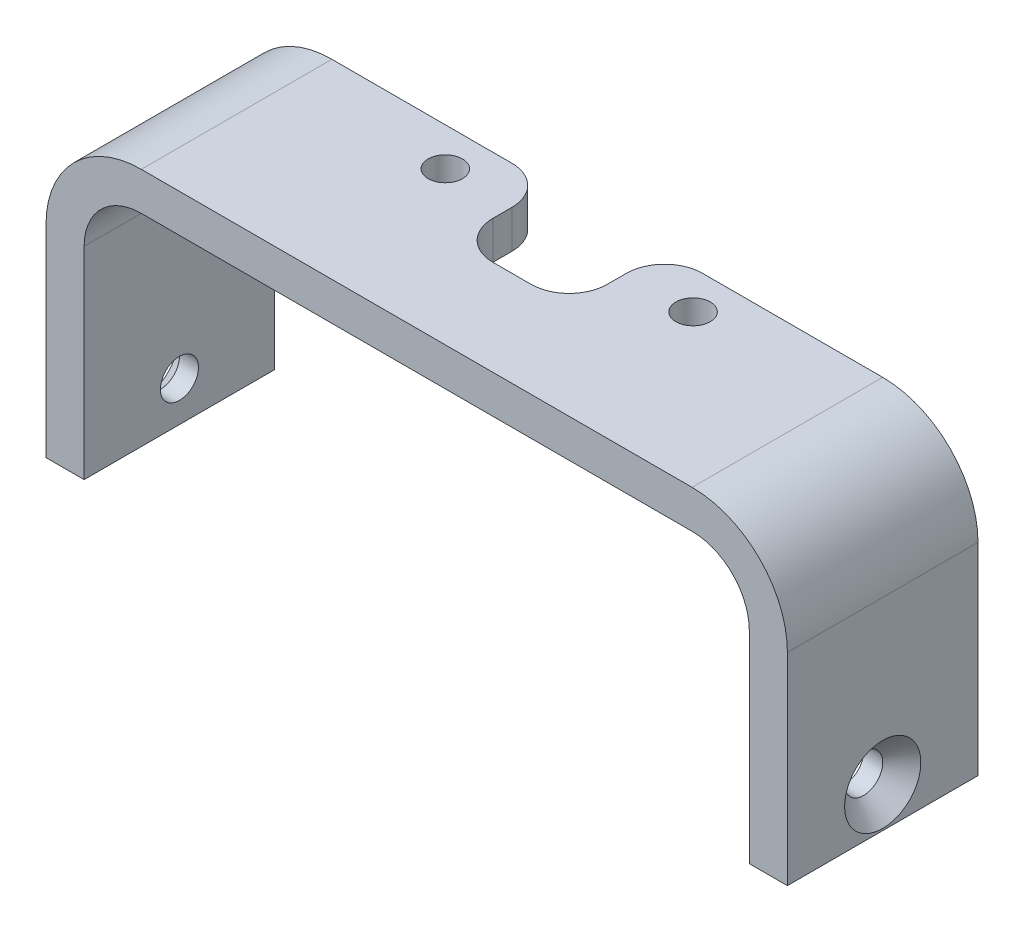
ISO-10303-21;
HEADER;
FILE_DESCRIPTION(('STEP AP214'),'2;1');
FILE_NAME('part.step','',(''),(''),'','','');
FILE_SCHEMA(('AUTOMOTIVE_DESIGN { 1 0 10303 214 1 1 1 1 }'));
ENDSEC;
DATA;
#1=APPLICATION_CONTEXT('core data for automotive mechanical design processes');
#2=APPLICATION_PROTOCOL_DEFINITION('international standard','automotive_design',2000,#1);
#3=PRODUCT_CONTEXT('',#1,'mechanical');
#4=PRODUCT('Part','Part','',(#3));
#5=PRODUCT_RELATED_PRODUCT_CATEGORY('part','',(#4));
#6=PRODUCT_DEFINITION_FORMATION('','',#4);
#7=PRODUCT_DEFINITION_CONTEXT('part definition',#1,'design');
#8=PRODUCT_DEFINITION('design','',#6,#7);
#9=PRODUCT_DEFINITION_SHAPE('','',#8);
#10=(LENGTH_UNIT() NAMED_UNIT(*) SI_UNIT(.MILLI.,.METRE.));
#11=(NAMED_UNIT(*) PLANE_ANGLE_UNIT() SI_UNIT($,.RADIAN.));
#12=(NAMED_UNIT(*) SI_UNIT($,.STERADIAN.) SOLID_ANGLE_UNIT());
#13=UNCERTAINTY_MEASURE_WITH_UNIT(LENGTH_MEASURE(1.E-05),#10,'distance_accuracy_value','');
#14=(GEOMETRIC_REPRESENTATION_CONTEXT(3) GLOBAL_UNCERTAINTY_ASSIGNED_CONTEXT((#13)) GLOBAL_UNIT_ASSIGNED_CONTEXT((#10,
#11,#12)) REPRESENTATION_CONTEXT('',''));
#15=CARTESIAN_POINT('',(0.,0.,0.));
#16=DIRECTION('',(0.,0.,1.));
#17=DIRECTION('',(1.,0.,0.));
#18=AXIS2_PLACEMENT_3D('',#15,#16,#17);
#19=CARTESIAN_POINT('',(-14.45,10.6,0.));
#20=DIRECTION('',(0.,0.,1.));
#21=DIRECTION('',(1.,0.,0.));
#22=AXIS2_PLACEMENT_3D('',#19,#20,#21);
#23=PLANE('',#22);
#24=DIRECTION('',(1.,0.,0.));
#25=VECTOR('',#24,1.);
#26=CARTESIAN_POINT('',(-14.45,13.6,0.));
#27=LINE('',#26,#25);
#28=CARTESIAN_POINT('',(4.99999999999999,13.6,0.));
#29=VERTEX_POINT('',#28);
#30=CARTESIAN_POINT('',(14.45,13.6,0.));
#31=VERTEX_POINT('',#30);
#32=EDGE_CURVE('E360',#29,#31,#27,.T.);
#33=ORIENTED_EDGE('',*,*,#32,.F.);
#34=DIRECTION('',(0.,1.,0.));
#35=VECTOR('',#34,1.);
#36=CARTESIAN_POINT('',(4.99999999999999,10.6,0.));
#37=LINE('',#36,#35);
#38=CARTESIAN_POINT('',(4.99999999999999,15.6,0.));
#39=VERTEX_POINT('',#38);
#40=EDGE_CURVE('E228',#29,#39,#37,.T.);
#41=ORIENTED_EDGE('',*,*,#40,.T.);
#42=DIRECTION('',(-1.,0.,0.));
#43=VECTOR('',#42,1.);
#44=CARTESIAN_POINT('',(-14.45,15.6,0.));
#45=LINE('',#44,#43);
#46=CARTESIAN_POINT('',(14.45,15.6,0.));
#47=VERTEX_POINT('',#46);
#48=EDGE_CURVE('E380',#47,#39,#45,.T.);
#49=ORIENTED_EDGE('',*,*,#48,.F.);
#50=CARTESIAN_POINT('',(14.45,10.6,0.));
#51=DIRECTION('',(0.,0.,1.));
#52=DIRECTION('',(1.,0.,0.));
#53=AXIS2_PLACEMENT_3D('',#50,#51,#52);
#54=CIRCLE('',#53,5.);
#55=CARTESIAN_POINT('',(19.45,10.6,0.));
#56=VERTEX_POINT('',#55);
#57=EDGE_CURVE('E376',#56,#47,#54,.T.);
#58=ORIENTED_EDGE('',*,*,#57,.F.);
#59=DIRECTION('',(0.,1.,0.));
#60=VECTOR('',#59,1.);
#61=CARTESIAN_POINT('',(19.45,0.,0.));
#62=LINE('',#61,#60);
#63=CARTESIAN_POINT('',(19.45,0.,0.));
#64=VERTEX_POINT('',#63);
#65=EDGE_CURVE('E373',#64,#56,#62,.T.);
#66=ORIENTED_EDGE('',*,*,#65,.F.);
#67=DIRECTION('',(1.,0.,0.));
#68=VECTOR('',#67,1.);
#69=CARTESIAN_POINT('',(17.45,0.,0.));
#70=LINE('',#69,#68);
#71=CARTESIAN_POINT('',(17.45,0.,0.));
#72=VERTEX_POINT('',#71);
#73=EDGE_CURVE('E370',#72,#64,#70,.T.);
#74=ORIENTED_EDGE('',*,*,#73,.F.);
#75=DIRECTION('',(0.,-1.,0.));
#76=VECTOR('',#75,1.);
#77=CARTESIAN_POINT('',(17.45,0.,0.));
#78=LINE('',#77,#76);
#79=CARTESIAN_POINT('',(17.45,10.6,0.));
#80=VERTEX_POINT('',#79);
#81=EDGE_CURVE('E367',#80,#72,#78,.T.);
#82=ORIENTED_EDGE('',*,*,#81,.F.);
#83=CARTESIAN_POINT('',(14.45,10.6,0.));
#84=DIRECTION('',(0.,0.,-1.));
#85=DIRECTION('',(1.,0.,0.));
#86=AXIS2_PLACEMENT_3D('',#83,#84,#85);
#87=CIRCLE('',#86,3.);
#88=EDGE_CURVE('E364',#31,#80,#87,.T.);
#89=ORIENTED_EDGE('',*,*,#88,.F.);
#90=EDGE_LOOP('',(#33,#41,#49,#58,#66,#74,#82,#89));
#91=FACE_BOUND('',#90,.T.);
#92=ADVANCED_FACE('F40',(#91),#23,.F.);
#93=CARTESIAN_POINT('',(-19.45,0.,10.));
#94=DIRECTION('',(0.,1.,0.));
#95=DIRECTION('',(0.,0.,1.));
#96=AXIS2_PLACEMENT_3D('',#93,#94,#95);
#97=PLANE('',#96);
#98=DIRECTION('',(1.,0.,0.));
#99=VECTOR('',#98,1.);
#100=CARTESIAN_POINT('',(-19.45,0.,0.));
#101=LINE('',#100,#99);
#102=CARTESIAN_POINT('',(-19.45,0.,0.));
#103=VERTEX_POINT('',#102);
#104=CARTESIAN_POINT('',(-17.45,0.,0.));
#105=VERTEX_POINT('',#104);
#106=EDGE_CURVE('E204',#103,#105,#101,.T.);
#107=ORIENTED_EDGE('',*,*,#106,.T.);
#108=DIRECTION('',(0.,0.,-1.));
#109=VECTOR('',#108,1.);
#110=CARTESIAN_POINT('',(-17.45,0.,10.));
#111=LINE('',#110,#109);
#112=CARTESIAN_POINT('',(-17.45,0.,10.));
#113=VERTEX_POINT('',#112);
#114=EDGE_CURVE('E182',#113,#105,#111,.T.);
#115=ORIENTED_EDGE('',*,*,#114,.F.);
#116=DIRECTION('',(1.,0.,0.));
#117=VECTOR('',#116,1.);
#118=CARTESIAN_POINT('',(-19.45,0.,10.));
#119=LINE('',#118,#117);
#120=CARTESIAN_POINT('',(-19.45,0.,10.));
#121=VERTEX_POINT('',#120);
#122=EDGE_CURVE('E190',#121,#113,#119,.T.);
#123=ORIENTED_EDGE('',*,*,#122,.F.);
#124=DIRECTION('',(0.,0.,-1.));
#125=VECTOR('',#124,1.);
#126=CARTESIAN_POINT('',(-19.45,0.,10.));
#127=LINE('',#126,#125);
#128=EDGE_CURVE('E351',#121,#103,#127,.T.);
#129=ORIENTED_EDGE('',*,*,#128,.T.);
#130=EDGE_LOOP('',(#107,#115,#123,#129));
#131=FACE_BOUND('',#130,.T.);
#132=ADVANCED_FACE('F202',(#131),#97,.F.);
#133=CARTESIAN_POINT('',(-17.45,0.,10.));
#134=DIRECTION('',(-1.,0.,0.));
#135=DIRECTION('',(0.,-1.,0.));
#136=AXIS2_PLACEMENT_3D('',#133,#134,#135);
#137=PLANE('',#136);
#138=CARTESIAN_POINT('',(-17.45,2.1,5.));
#139=DIRECTION('',(-1.,0.,0.));
#140=DIRECTION('',(0.,-1.,0.));
#141=AXIS2_PLACEMENT_3D('',#138,#139,#140);
#142=CIRCLE('',#141,1.);
#143=CARTESIAN_POINT('',(-17.45,1.1,5.));
#144=VERTEX_POINT('',#143);
#145=EDGE_CURVE('E319',#144,#144,#142,.T.);
#146=ORIENTED_EDGE('',*,*,#145,.T.);
#147=EDGE_LOOP('',(#146));
#148=FACE_BOUND('',#147,.T.);
#149=DIRECTION('',(0.,1.,0.));
#150=VECTOR('',#149,1.);
#151=CARTESIAN_POINT('',(-17.45,0.,0.));
#152=LINE('',#151,#150);
#153=CARTESIAN_POINT('',(-17.45,10.6,0.));
#154=VERTEX_POINT('',#153);
#155=EDGE_CURVE('E354',#105,#154,#152,.T.);
#156=ORIENTED_EDGE('',*,*,#155,.T.);
#157=DIRECTION('',(0.,0.,-1.));
#158=VECTOR('',#157,1.);
#159=CARTESIAN_POINT('',(-17.45,10.6,10.));
#160=LINE('',#159,#158);
#161=CARTESIAN_POINT('',(-17.45,10.6,10.));
#162=VERTEX_POINT('',#161);
#163=EDGE_CURVE('E185',#162,#154,#160,.T.);
#164=ORIENTED_EDGE('',*,*,#163,.F.);
#165=DIRECTION('',(0.,1.,0.));
#166=VECTOR('',#165,1.);
#167=CARTESIAN_POINT('',(-17.45,0.,10.));
#168=LINE('',#167,#166);
#169=EDGE_CURVE('E178',#113,#162,#168,.T.);
#170=ORIENTED_EDGE('',*,*,#169,.F.);
#171=ORIENTED_EDGE('',*,*,#114,.T.);
#172=EDGE_LOOP('',(#156,#164,#170,#171));
#173=FACE_BOUND('',#172,.T.);
#174=ADVANCED_FACE('F180',(#148,#173),#137,.F.);
#175=CARTESIAN_POINT('',(-14.45,10.6,10.));
#176=DIRECTION('',(0.,0.,-1.));
#177=DIRECTION('',(-1.,0.,0.));
#178=AXIS2_PLACEMENT_3D('',#175,#176,#177);
#179=CYLINDRICAL_SURFACE('',#178,3.);
#180=CARTESIAN_POINT('',(-14.45,10.6,0.));
#181=DIRECTION('',(0.,0.,-1.));
#182=DIRECTION('',(1.,0.,0.));
#183=AXIS2_PLACEMENT_3D('',#180,#181,#182);
#184=CIRCLE('',#183,3.);
#185=CARTESIAN_POINT('',(-14.45,13.6,0.));
#186=VERTEX_POINT('',#185);
#187=EDGE_CURVE('E357',#154,#186,#184,.T.);
#188=ORIENTED_EDGE('',*,*,#187,.T.);
#189=DIRECTION('',(0.,0.,-1.));
#190=VECTOR('',#189,1.);
#191=CARTESIAN_POINT('',(-14.45,13.6,10.));
#192=LINE('',#191,#190);
#193=CARTESIAN_POINT('',(-14.45,13.6,10.));
#194=VERTEX_POINT('',#193);
#195=EDGE_CURVE('E213',#194,#186,#192,.T.);
#196=ORIENTED_EDGE('',*,*,#195,.F.);
#197=CARTESIAN_POINT('',(-14.45,10.6,10.));
#198=DIRECTION('',(0.,0.,-1.));
#199=DIRECTION('',(1.,0.,0.));
#200=AXIS2_PLACEMENT_3D('',#197,#198,#199);
#201=CIRCLE('',#200,3.);
#202=EDGE_CURVE('E189',#162,#194,#201,.T.);
#203=ORIENTED_EDGE('',*,*,#202,.F.);
#204=ORIENTED_EDGE('',*,*,#163,.T.);
#205=EDGE_LOOP('',(#188,#196,#203,#204));
#206=FACE_BOUND('',#205,.T.);
#207=ADVANCED_FACE('F511',(#206),#179,.F.);
#208=CARTESIAN_POINT('',(-14.45,13.6,10.));
#209=DIRECTION('',(0.,1.,0.));
#210=DIRECTION('',(-1.,0.,0.));
#211=AXIS2_PLACEMENT_3D('',#208,#209,#210);
#212=PLANE('',#211);
#213=CARTESIAN_POINT('',(-6.5,13.6,2.));
#214=DIRECTION('',(0.,1.,0.));
#215=DIRECTION('',(-1.,0.,0.));
#216=AXIS2_PLACEMENT_3D('',#213,#214,#215);
#217=CIRCLE('',#216,0.899999999999999);
#218=CARTESIAN_POINT('',(-7.4,13.6,2.));
#219=VERTEX_POINT('',#218);
#220=EDGE_CURVE('E307',#219,#219,#217,.T.);
#221=ORIENTED_EDGE('',*,*,#220,.T.);
#222=EDGE_LOOP('',(#221));
#223=FACE_BOUND('',#222,.T.);
#224=CARTESIAN_POINT('',(6.5,13.6,2.));
#225=DIRECTION('',(0.,1.,0.));
#226=DIRECTION('',(-1.,0.,0.));
#227=AXIS2_PLACEMENT_3D('',#224,#225,#226);
#228=CIRCLE('',#227,0.9);
#229=CARTESIAN_POINT('',(5.6,13.6,2.));
#230=VERTEX_POINT('',#229);
#231=EDGE_CURVE('E301',#230,#230,#228,.T.);
#232=ORIENTED_EDGE('',*,*,#231,.T.);
#233=EDGE_LOOP('',(#232));
#234=FACE_BOUND('',#233,.T.);
#235=DIRECTION('',(0.,0.,-1.));
#236=VECTOR('',#235,1.);
#237=CARTESIAN_POINT('',(3.,13.6,10.));
#238=LINE('',#237,#236);
#239=CARTESIAN_POINT('',(2.99999999999999,13.6,3.));
#240=VERTEX_POINT('',#239);
#241=CARTESIAN_POINT('',(2.99999999999999,13.6,2.));
#242=VERTEX_POINT('',#241);
#243=EDGE_CURVE('E302',#240,#242,#238,.T.);
#244=ORIENTED_EDGE('',*,*,#243,.T.);
#245=CARTESIAN_POINT('',(4.99999999999999,13.6,2.));
#246=DIRECTION('',(0.,1.,0.));
#247=DIRECTION('',(-1.,0.,0.));
#248=AXIS2_PLACEMENT_3D('',#245,#246,#247);
#249=CIRCLE('',#248,2.);
#250=EDGE_CURVE('E247',#242,#29,#249,.F.);
#251=ORIENTED_EDGE('',*,*,#250,.T.);
#252=ORIENTED_EDGE('',*,*,#32,.T.);
#253=DIRECTION('',(0.,0.,-1.));
#254=VECTOR('',#253,1.);
#255=CARTESIAN_POINT('',(14.45,13.6,10.));
#256=LINE('',#255,#254);
#257=CARTESIAN_POINT('',(14.45,13.6,10.));
#258=VERTEX_POINT('',#257);
#259=EDGE_CURVE('E418',#258,#31,#256,.T.);
#260=ORIENTED_EDGE('',*,*,#259,.F.);
#261=DIRECTION('',(1.,0.,0.));
#262=VECTOR('',#261,1.);
#263=CARTESIAN_POINT('',(-14.45,13.6,10.));
#264=LINE('',#263,#262);
#265=EDGE_CURVE('E325',#194,#258,#264,.T.);
#266=ORIENTED_EDGE('',*,*,#265,.F.);
#267=ORIENTED_EDGE('',*,*,#195,.T.);
#268=CARTESIAN_POINT('',(-5.,13.6,0.));
#269=VERTEX_POINT('',#268);
#270=EDGE_CURVE('E361',#186,#269,#27,.T.);
#271=ORIENTED_EDGE('',*,*,#270,.T.);
#272=CARTESIAN_POINT('',(-5.,13.6,2.));
#273=DIRECTION('',(0.,1.,0.));
#274=DIRECTION('',(-1.,0.,0.));
#275=AXIS2_PLACEMENT_3D('',#272,#273,#274);
#276=CIRCLE('',#275,2.);
#277=CARTESIAN_POINT('',(-3.,13.6,2.));
#278=VERTEX_POINT('',#277);
#279=EDGE_CURVE('E63',#269,#278,#276,.F.);
#280=ORIENTED_EDGE('',*,*,#279,.T.);
#281=DIRECTION('',(0.,0.,1.));
#282=VECTOR('',#281,1.);
#283=CARTESIAN_POINT('',(-3.,13.6,10.));
#284=LINE('',#283,#282);
#285=CARTESIAN_POINT('',(-3.,13.6,3.));
#286=VERTEX_POINT('',#285);
#287=EDGE_CURVE('E296',#278,#286,#284,.T.);
#288=ORIENTED_EDGE('',*,*,#287,.T.);
#289=CARTESIAN_POINT('',(-1.,13.6,3.));
#290=DIRECTION('',(0.,1.,0.));
#291=DIRECTION('',(-1.,0.,0.));
#292=AXIS2_PLACEMENT_3D('',#289,#290,#291);
#293=CIRCLE('',#292,2.);
#294=CARTESIAN_POINT('',(-1.,13.6,5.));
#295=VERTEX_POINT('',#294);
#296=EDGE_CURVE('E11',#286,#295,#293,.T.);
#297=ORIENTED_EDGE('',*,*,#296,.T.);
#298=DIRECTION('',(1.,0.,0.));
#299=VECTOR('',#298,1.);
#300=CARTESIAN_POINT('',(-14.45,13.6,5.));
#301=LINE('',#300,#299);
#302=CARTESIAN_POINT('',(0.999999999999997,13.6,5.00000000000001));
#303=VERTEX_POINT('',#302);
#304=EDGE_CURVE('E294',#295,#303,#301,.T.);
#305=ORIENTED_EDGE('',*,*,#304,.T.);
#306=CARTESIAN_POINT('',(0.999999999999997,13.6,3.));
#307=DIRECTION('',(0.,1.,0.));
#308=DIRECTION('',(-1.,0.,0.));
#309=AXIS2_PLACEMENT_3D('',#306,#307,#308);
#310=CIRCLE('',#309,2.);
#311=EDGE_CURVE('E269',#303,#240,#310,.T.);
#312=ORIENTED_EDGE('',*,*,#311,.T.);
#313=EDGE_LOOP('',(#244,#251,#252,#260,#266,#267,#271,#280,#288,#297,#305,#312));
#314=FACE_BOUND('',#313,.T.);
#315=ADVANCED_FACE('F293',(#223,#234,#314),#212,.F.);
#316=CARTESIAN_POINT('',(14.45,10.6,10.));
#317=DIRECTION('',(0.,0.,-1.));
#318=DIRECTION('',(-1.,0.,0.));
#319=AXIS2_PLACEMENT_3D('',#316,#317,#318);
#320=CYLINDRICAL_SURFACE('',#319,3.);
#321=ORIENTED_EDGE('',*,*,#88,.T.);
#322=DIRECTION('',(0.,0.,-1.));
#323=VECTOR('',#322,1.);
#324=CARTESIAN_POINT('',(17.45,10.6,10.));
#325=LINE('',#324,#323);
#326=CARTESIAN_POINT('',(17.45,10.6,10.));
#327=VERTEX_POINT('',#326);
#328=EDGE_CURVE('E414',#327,#80,#325,.T.);
#329=ORIENTED_EDGE('',*,*,#328,.F.);
#330=CARTESIAN_POINT('',(14.45,10.6,10.));
#331=DIRECTION('',(0.,0.,-1.));
#332=DIRECTION('',(1.,0.,0.));
#333=AXIS2_PLACEMENT_3D('',#330,#331,#332);
#334=CIRCLE('',#333,3.);
#335=EDGE_CURVE('E328',#258,#327,#334,.T.);
#336=ORIENTED_EDGE('',*,*,#335,.F.);
#337=ORIENTED_EDGE('',*,*,#259,.T.);
#338=EDGE_LOOP('',(#321,#329,#336,#337));
#339=FACE_BOUND('',#338,.T.);
#340=ADVANCED_FACE('F510',(#339),#320,.F.);
#341=CARTESIAN_POINT('',(17.45,0.,10.));
#342=DIRECTION('',(1.,0.,0.));
#343=DIRECTION('',(0.,1.,0.));
#344=AXIS2_PLACEMENT_3D('',#341,#342,#343);
#345=PLANE('',#344);
#346=CARTESIAN_POINT('',(17.45,2.1,5.));
#347=DIRECTION('',(1.,0.,0.));
#348=DIRECTION('',(0.,1.,0.));
#349=AXIS2_PLACEMENT_3D('',#346,#347,#348);
#350=CIRCLE('',#349,1.);
#351=CARTESIAN_POINT('',(17.45,3.1,5.));
#352=VERTEX_POINT('',#351);
#353=EDGE_CURVE('E315',#352,#352,#350,.T.);
#354=ORIENTED_EDGE('',*,*,#353,.T.);
#355=EDGE_LOOP('',(#354));
#356=FACE_BOUND('',#355,.T.);
#357=ORIENTED_EDGE('',*,*,#81,.T.);
#358=DIRECTION('',(0.,0.,-1.));
#359=VECTOR('',#358,1.);
#360=CARTESIAN_POINT('',(17.45,0.,10.));
#361=LINE('',#360,#359);
#362=CARTESIAN_POINT('',(17.45,0.,10.));
#363=VERTEX_POINT('',#362);
#364=EDGE_CURVE('E410',#363,#72,#361,.T.);
#365=ORIENTED_EDGE('',*,*,#364,.F.);
#366=DIRECTION('',(0.,-1.,0.));
#367=VECTOR('',#366,1.);
#368=CARTESIAN_POINT('',(17.45,0.,10.));
#369=LINE('',#368,#367);
#370=EDGE_CURVE('E331',#327,#363,#369,.T.);
#371=ORIENTED_EDGE('',*,*,#370,.F.);
#372=ORIENTED_EDGE('',*,*,#328,.T.);
#373=EDGE_LOOP('',(#357,#365,#371,#372));
#374=FACE_BOUND('',#373,.T.);
#375=ADVANCED_FACE('F518',(#356,#374),#345,.F.);
#376=CARTESIAN_POINT('',(17.45,0.,10.));
#377=DIRECTION('',(0.,1.,0.));
#378=DIRECTION('',(-1.,0.,0.));
#379=AXIS2_PLACEMENT_3D('',#376,#377,#378);
#380=PLANE('',#379);
#381=ORIENTED_EDGE('',*,*,#73,.T.);
#382=DIRECTION('',(0.,0.,-1.));
#383=VECTOR('',#382,1.);
#384=CARTESIAN_POINT('',(19.45,0.,10.));
#385=LINE('',#384,#383);
#386=CARTESIAN_POINT('',(19.45,0.,10.));
#387=VERTEX_POINT('',#386);
#388=EDGE_CURVE('E406',#387,#64,#385,.T.);
#389=ORIENTED_EDGE('',*,*,#388,.F.);
#390=DIRECTION('',(1.,0.,0.));
#391=VECTOR('',#390,1.);
#392=CARTESIAN_POINT('',(17.45,0.,10.));
#393=LINE('',#392,#391);
#394=EDGE_CURVE('E334',#363,#387,#393,.T.);
#395=ORIENTED_EDGE('',*,*,#394,.F.);
#396=ORIENTED_EDGE('',*,*,#364,.T.);
#397=EDGE_LOOP('',(#381,#389,#395,#396));
#398=FACE_BOUND('',#397,.T.);
#399=ADVANCED_FACE('F624',(#398),#380,.F.);
#400=CARTESIAN_POINT('',(19.45,0.,10.));
#401=DIRECTION('',(-1.,0.,0.));
#402=DIRECTION('',(0.,0.,1.));
#403=AXIS2_PLACEMENT_3D('',#400,#401,#402);
#404=PLANE('',#403);
#405=CARTESIAN_POINT('',(19.45,2.1,5.));
#406=DIRECTION('',(-1.,0.,0.));
#407=DIRECTION('',(0.,0.,1.));
#408=AXIS2_PLACEMENT_3D('',#405,#406,#407);
#409=CIRCLE('',#408,2.);
#410=CARTESIAN_POINT('',(19.45,2.1,7.));
#411=VERTEX_POINT('',#410);
#412=EDGE_CURVE('E220',#411,#411,#409,.T.);
#413=ORIENTED_EDGE('',*,*,#412,.T.);
#414=EDGE_LOOP('',(#413));
#415=FACE_BOUND('',#414,.T.);
#416=ORIENTED_EDGE('',*,*,#65,.T.);
#417=DIRECTION('',(0.,0.,-1.));
#418=VECTOR('',#417,1.);
#419=CARTESIAN_POINT('',(19.45,10.6,10.));
#420=LINE('',#419,#418);
#421=CARTESIAN_POINT('',(19.45,10.6,10.));
#422=VERTEX_POINT('',#421);
#423=EDGE_CURVE('E402',#422,#56,#420,.T.);
#424=ORIENTED_EDGE('',*,*,#423,.F.);
#425=DIRECTION('',(0.,1.,0.));
#426=VECTOR('',#425,1.);
#427=CARTESIAN_POINT('',(19.45,0.,10.));
#428=LINE('',#427,#426);
#429=EDGE_CURVE('E337',#387,#422,#428,.T.);
#430=ORIENTED_EDGE('',*,*,#429,.F.);
#431=ORIENTED_EDGE('',*,*,#388,.T.);
#432=EDGE_LOOP('',(#416,#424,#430,#431));
#433=FACE_BOUND('',#432,.T.);
#434=ADVANCED_FACE('F618',(#415,#433),#404,.F.);
#435=CARTESIAN_POINT('',(14.45,10.6,10.));
#436=DIRECTION('',(0.,0.,-1.));
#437=DIRECTION('',(-1.,0.,0.));
#438=AXIS2_PLACEMENT_3D('',#435,#436,#437);
#439=CYLINDRICAL_SURFACE('',#438,5.);
#440=ORIENTED_EDGE('',*,*,#57,.T.);
#441=DIRECTION('',(0.,0.,-1.));
#442=VECTOR('',#441,1.);
#443=CARTESIAN_POINT('',(14.45,15.6,10.));
#444=LINE('',#443,#442);
#445=CARTESIAN_POINT('',(14.45,15.6,10.));
#446=VERTEX_POINT('',#445);
#447=EDGE_CURVE('E398',#446,#47,#444,.T.);
#448=ORIENTED_EDGE('',*,*,#447,.F.);
#449=CARTESIAN_POINT('',(14.45,10.6,10.));
#450=DIRECTION('',(0.,0.,1.));
#451=DIRECTION('',(1.,0.,0.));
#452=AXIS2_PLACEMENT_3D('',#449,#450,#451);
#453=CIRCLE('',#452,5.);
#454=EDGE_CURVE('E340',#422,#446,#453,.T.);
#455=ORIENTED_EDGE('',*,*,#454,.F.);
#456=ORIENTED_EDGE('',*,*,#423,.T.);
#457=EDGE_LOOP('',(#440,#448,#455,#456));
#458=FACE_BOUND('',#457,.T.);
#459=ADVANCED_FACE('F623',(#458),#439,.T.);
#460=CARTESIAN_POINT('',(-14.45,15.6,10.));
#461=DIRECTION('',(0.,-1.,0.));
#462=DIRECTION('',(1.,0.,0.));
#463=AXIS2_PLACEMENT_3D('',#460,#461,#462);
#464=PLANE('',#463);
#465=CARTESIAN_POINT('',(-6.5,15.6,2.));
#466=DIRECTION('',(0.,1.,0.));
#467=DIRECTION('',(-1.,0.,0.));
#468=AXIS2_PLACEMENT_3D('',#465,#466,#467);
#469=CIRCLE('',#468,0.899999999999999);
#470=CARTESIAN_POINT('',(-7.4,15.6,2.));
#471=VERTEX_POINT('',#470);
#472=EDGE_CURVE('E506',#471,#471,#469,.T.);
#473=ORIENTED_EDGE('',*,*,#472,.F.);
#474=EDGE_LOOP('',(#473));
#475=FACE_BOUND('',#474,.T.);
#476=CARTESIAN_POINT('',(6.5,15.6,2.));
#477=DIRECTION('',(0.,1.,0.));
#478=DIRECTION('',(-1.,0.,0.));
#479=AXIS2_PLACEMENT_3D('',#476,#477,#478);
#480=CIRCLE('',#479,0.9);
#481=CARTESIAN_POINT('',(5.6,15.6,2.));
#482=VERTEX_POINT('',#481);
#483=EDGE_CURVE('E701',#482,#482,#480,.T.);
#484=ORIENTED_EDGE('',*,*,#483,.F.);
#485=EDGE_LOOP('',(#484));
#486=FACE_BOUND('',#485,.T.);
#487=ORIENTED_EDGE('',*,*,#48,.T.);
#488=CARTESIAN_POINT('',(4.99999999999999,15.6,2.));
#489=DIRECTION('',(0.,-1.,0.));
#490=DIRECTION('',(1.,0.,0.));
#491=AXIS2_PLACEMENT_3D('',#488,#489,#490);
#492=CIRCLE('',#491,2.);
#493=CARTESIAN_POINT('',(3.,15.6,2.));
#494=VERTEX_POINT('',#493);
#495=EDGE_CURVE('E235',#39,#494,#492,.F.);
#496=ORIENTED_EDGE('',*,*,#495,.T.);
#497=DIRECTION('',(0.,0.,-1.));
#498=VECTOR('',#497,1.);
#499=CARTESIAN_POINT('',(3.,15.6,0.));
#500=LINE('',#499,#498);
#501=CARTESIAN_POINT('',(3.,15.6,3.));
#502=VERTEX_POINT('',#501);
#503=EDGE_CURVE('E286',#502,#494,#500,.T.);
#504=ORIENTED_EDGE('',*,*,#503,.F.);
#505=CARTESIAN_POINT('',(0.999999999999997,15.6,3.));
#506=DIRECTION('',(0.,-1.,0.));
#507=DIRECTION('',(1.,0.,0.));
#508=AXIS2_PLACEMENT_3D('',#505,#506,#507);
#509=CIRCLE('',#508,2.);
#510=CARTESIAN_POINT('',(0.999999999999997,15.6,5.00000000000001));
#511=VERTEX_POINT('',#510);
#512=EDGE_CURVE('E266',#502,#511,#509,.T.);
#513=ORIENTED_EDGE('',*,*,#512,.T.);
#514=DIRECTION('',(1.,0.,0.));
#515=VECTOR('',#514,1.);
#516=CARTESIAN_POINT('',(3.,15.6,5.00000000000001));
#517=LINE('',#516,#515);
#518=CARTESIAN_POINT('',(-1.,15.6,5.));
#519=VERTEX_POINT('',#518);
#520=EDGE_CURVE('E280',#519,#511,#517,.T.);
#521=ORIENTED_EDGE('',*,*,#520,.F.);
#522=CARTESIAN_POINT('',(-1.,15.6,3.));
#523=DIRECTION('',(0.,-1.,0.));
#524=DIRECTION('',(1.,0.,0.));
#525=AXIS2_PLACEMENT_3D('',#522,#523,#524);
#526=CIRCLE('',#525,2.);
#527=CARTESIAN_POINT('',(-3.,15.6,3.));
#528=VERTEX_POINT('',#527);
#529=EDGE_CURVE('E49',#519,#528,#526,.T.);
#530=ORIENTED_EDGE('',*,*,#529,.T.);
#531=DIRECTION('',(0.,0.,1.));
#532=VECTOR('',#531,1.);
#533=CARTESIAN_POINT('',(-3.,15.6,0.));
#534=LINE('',#533,#532);
#535=CARTESIAN_POINT('',(-3.,15.6,2.));
#536=VERTEX_POINT('',#535);
#537=EDGE_CURVE('E277',#536,#528,#534,.T.);
#538=ORIENTED_EDGE('',*,*,#537,.F.);
#539=CARTESIAN_POINT('',(-5.,15.6,2.));
#540=DIRECTION('',(0.,-1.,0.));
#541=DIRECTION('',(1.,0.,0.));
#542=AXIS2_PLACEMENT_3D('',#539,#540,#541);
#543=CIRCLE('',#542,2.);
#544=CARTESIAN_POINT('',(-5.,15.6,0.));
#545=VERTEX_POINT('',#544);
#546=EDGE_CURVE('E232',#536,#545,#543,.F.);
#547=ORIENTED_EDGE('',*,*,#546,.T.);
#548=CARTESIAN_POINT('',(-14.45,15.6,0.));
#549=VERTEX_POINT('',#548);
#550=EDGE_CURVE('E379',#545,#549,#45,.T.);
#551=ORIENTED_EDGE('',*,*,#550,.T.);
#552=DIRECTION('',(0.,0.,-1.));
#553=VECTOR('',#552,1.);
#554=CARTESIAN_POINT('',(-14.45,15.6,10.));
#555=LINE('',#554,#553);
#556=CARTESIAN_POINT('',(-14.45,15.6,10.));
#557=VERTEX_POINT('',#556);
#558=EDGE_CURVE('E394',#557,#549,#555,.T.);
#559=ORIENTED_EDGE('',*,*,#558,.F.);
#560=DIRECTION('',(-1.,0.,0.));
#561=VECTOR('',#560,1.);
#562=CARTESIAN_POINT('',(-14.45,15.6,10.));
#563=LINE('',#562,#561);
#564=EDGE_CURVE('E343',#446,#557,#563,.T.);
#565=ORIENTED_EDGE('',*,*,#564,.F.);
#566=ORIENTED_EDGE('',*,*,#447,.T.);
#567=EDGE_LOOP('',(#487,#496,#504,#513,#521,#530,#538,#547,#551,#559,#565,#566));
#568=FACE_BOUND('',#567,.T.);
#569=ADVANCED_FACE('F276',(#475,#486,#568),#464,.F.);
#570=CARTESIAN_POINT('',(-14.45,10.6,10.));
#571=DIRECTION('',(0.,0.,-1.));
#572=DIRECTION('',(-1.,0.,0.));
#573=AXIS2_PLACEMENT_3D('',#570,#571,#572);
#574=CYLINDRICAL_SURFACE('',#573,5.);
#575=CARTESIAN_POINT('',(-14.45,10.6,0.));
#576=DIRECTION('',(0.,0.,1.));
#577=DIRECTION('',(1.,0.,0.));
#578=AXIS2_PLACEMENT_3D('',#575,#576,#577);
#579=CIRCLE('',#578,5.);
#580=CARTESIAN_POINT('',(-19.45,10.6,0.));
#581=VERTEX_POINT('',#580);
#582=EDGE_CURVE('E383',#549,#581,#579,.T.);
#583=ORIENTED_EDGE('',*,*,#582,.T.);
#584=DIRECTION('',(0.,0.,-1.));
#585=VECTOR('',#584,1.);
#586=CARTESIAN_POINT('',(-19.45,10.6,10.));
#587=LINE('',#586,#585);
#588=CARTESIAN_POINT('',(-19.45,10.6,10.));
#589=VERTEX_POINT('',#588);
#590=EDGE_CURVE('E390',#589,#581,#587,.T.);
#591=ORIENTED_EDGE('',*,*,#590,.F.);
#592=CARTESIAN_POINT('',(-14.45,10.6,10.));
#593=DIRECTION('',(0.,0.,1.));
#594=DIRECTION('',(1.,0.,0.));
#595=AXIS2_PLACEMENT_3D('',#592,#593,#594);
#596=CIRCLE('',#595,5.);
#597=EDGE_CURVE('E346',#557,#589,#596,.T.);
#598=ORIENTED_EDGE('',*,*,#597,.F.);
#599=ORIENTED_EDGE('',*,*,#558,.T.);
#600=EDGE_LOOP('',(#583,#591,#598,#599));
#601=FACE_BOUND('',#600,.T.);
#602=ADVANCED_FACE('F440',(#601),#574,.T.);
#603=CARTESIAN_POINT('',(-19.45,0.,10.));
#604=DIRECTION('',(1.,0.,0.));
#605=DIRECTION('',(0.,1.,0.));
#606=AXIS2_PLACEMENT_3D('',#603,#604,#605);
#607=PLANE('',#606);
#608=CARTESIAN_POINT('',(-19.45,2.1,5.));
#609=DIRECTION('',(1.,0.,0.));
#610=DIRECTION('',(0.,1.,0.));
#611=AXIS2_PLACEMENT_3D('',#608,#609,#610);
#612=CIRCLE('',#611,2.);
#613=CARTESIAN_POINT('',(-19.45,4.1,5.));
#614=VERTEX_POINT('',#613);
#615=EDGE_CURVE('E206',#614,#614,#612,.T.);
#616=ORIENTED_EDGE('',*,*,#615,.T.);
#617=EDGE_LOOP('',(#616));
#618=FACE_BOUND('',#617,.T.);
#619=DIRECTION('',(0.,-1.,0.));
#620=VECTOR('',#619,1.);
#621=CARTESIAN_POINT('',(-19.45,0.,0.));
#622=LINE('',#621,#620);
#623=EDGE_CURVE('E200',#581,#103,#622,.T.);
#624=ORIENTED_EDGE('',*,*,#623,.T.);
#625=ORIENTED_EDGE('',*,*,#128,.F.);
#626=DIRECTION('',(0.,-1.,0.));
#627=VECTOR('',#626,1.);
#628=CARTESIAN_POINT('',(-19.45,0.,10.));
#629=LINE('',#628,#627);
#630=EDGE_CURVE('E195',#589,#121,#629,.T.);
#631=ORIENTED_EDGE('',*,*,#630,.F.);
#632=ORIENTED_EDGE('',*,*,#590,.T.);
#633=EDGE_LOOP('',(#624,#625,#631,#632));
#634=FACE_BOUND('',#633,.T.);
#635=ADVANCED_FACE('F444',(#618,#634),#607,.F.);
#636=CARTESIAN_POINT('',(-14.45,10.6,10.));
#637=DIRECTION('',(0.,0.,1.));
#638=DIRECTION('',(1.,0.,0.));
#639=AXIS2_PLACEMENT_3D('',#636,#637,#638);
#640=PLANE('',#639);
#641=ORIENTED_EDGE('',*,*,#122,.T.);
#642=ORIENTED_EDGE('',*,*,#169,.T.);
#643=ORIENTED_EDGE('',*,*,#202,.T.);
#644=ORIENTED_EDGE('',*,*,#265,.T.);
#645=ORIENTED_EDGE('',*,*,#335,.T.);
#646=ORIENTED_EDGE('',*,*,#370,.T.);
#647=ORIENTED_EDGE('',*,*,#394,.T.);
#648=ORIENTED_EDGE('',*,*,#429,.T.);
#649=ORIENTED_EDGE('',*,*,#454,.T.);
#650=ORIENTED_EDGE('',*,*,#564,.T.);
#651=ORIENTED_EDGE('',*,*,#597,.T.);
#652=ORIENTED_EDGE('',*,*,#630,.T.);
#653=EDGE_LOOP('',(#641,#642,#643,#644,#645,#646,#647,#648,#649,#650,#651,#652));
#654=FACE_BOUND('',#653,.T.);
#655=ADVANCED_FACE('F193',(#654),#640,.T.);
#656=ORIENTED_EDGE('',*,*,#550,.F.);
#657=DIRECTION('',(0.,-1.,0.));
#658=VECTOR('',#657,1.);
#659=CARTESIAN_POINT('',(-5.,10.6,0.));
#660=LINE('',#659,#658);
#661=EDGE_CURVE('E262',#545,#269,#660,.T.);
#662=ORIENTED_EDGE('',*,*,#661,.T.);
#663=ORIENTED_EDGE('',*,*,#270,.F.);
#664=ORIENTED_EDGE('',*,*,#187,.F.);
#665=ORIENTED_EDGE('',*,*,#155,.F.);
#666=ORIENTED_EDGE('',*,*,#106,.F.);
#667=ORIENTED_EDGE('',*,*,#623,.F.);
#668=ORIENTED_EDGE('',*,*,#582,.F.);
#669=EDGE_LOOP('',(#656,#662,#663,#664,#665,#666,#667,#668));
#670=FACE_BOUND('',#669,.T.);
#671=ADVANCED_FACE('F431',(#670),#23,.F.);
#672=CARTESIAN_POINT('',(-19.45,2.1,5.));
#673=DIRECTION('',(1.,0.,0.));
#674=DIRECTION('',(0.,1.,0.));
#675=AXIS2_PLACEMENT_3D('',#672,#673,#674);
#676=CYLINDRICAL_SURFACE('',#675,1.);
#677=CARTESIAN_POINT('',(-18.45,2.1,5.));
#678=DIRECTION('',(1.,0.,0.));
#679=DIRECTION('',(0.,0.,-1.));
#680=AXIS2_PLACEMENT_3D('',#677,#678,#679);
#681=CIRCLE('',#680,1.);
#682=CARTESIAN_POINT('',(-18.45,2.1,4.));
#683=VERTEX_POINT('',#682);
#684=EDGE_CURVE('E211',#683,#683,#681,.F.);
#685=ORIENTED_EDGE('',*,*,#684,.T.);
#686=EDGE_LOOP('',(#685));
#687=FACE_BOUND('',#686,.T.);
#688=ORIENTED_EDGE('',*,*,#145,.F.);
#689=EDGE_LOOP('',(#688));
#690=FACE_BOUND('',#689,.T.);
#691=ADVANCED_FACE('F465',(#687,#690),#676,.F.);
#692=CARTESIAN_POINT('',(18.45,2.1,5.));
#693=DIRECTION('',(-1.,0.,0.));
#694=DIRECTION('',(0.,0.,1.));
#695=AXIS2_PLACEMENT_3D('',#692,#693,#694);
#696=CIRCLE('',#695,1.);
#697=CARTESIAN_POINT('',(18.45,2.1,6.));
#698=VERTEX_POINT('',#697);
#699=EDGE_CURVE('E224',#698,#698,#696,.F.);
#700=ORIENTED_EDGE('',*,*,#699,.T.);
#701=EDGE_LOOP('',(#700));
#702=FACE_BOUND('',#701,.T.);
#703=ORIENTED_EDGE('',*,*,#353,.F.);
#704=EDGE_LOOP('',(#703));
#705=FACE_BOUND('',#704,.T.);
#706=ADVANCED_FACE('F471',(#702,#705),#676,.F.);
#707=CARTESIAN_POINT('',(-19.45,2.1,5.));
#708=DIRECTION('',(-1.,0.,0.));
#709=DIRECTION('',(0.,0.,1.));
#710=AXIS2_PLACEMENT_3D('',#707,#708,#709);
#711=CONICAL_SURFACE('',#710,2.,0.785398163397449);
#712=ORIENTED_EDGE('',*,*,#684,.F.);
#713=EDGE_LOOP('',(#712));
#714=FACE_BOUND('',#713,.T.);
#715=ORIENTED_EDGE('',*,*,#615,.F.);
#716=EDGE_LOOP('',(#715));
#717=FACE_BOUND('',#716,.T.);
#718=ADVANCED_FACE('F477',(#714,#717),#711,.F.);
#719=CARTESIAN_POINT('',(19.45,2.1,5.));
#720=DIRECTION('',(1.,0.,0.));
#721=DIRECTION('',(0.,0.,-1.));
#722=AXIS2_PLACEMENT_3D('',#719,#720,#721);
#723=CONICAL_SURFACE('',#722,2.,0.785398163397444);
#724=ORIENTED_EDGE('',*,*,#699,.F.);
#725=EDGE_LOOP('',(#724));
#726=FACE_BOUND('',#725,.T.);
#727=ORIENTED_EDGE('',*,*,#412,.F.);
#728=EDGE_LOOP('',(#727));
#729=FACE_BOUND('',#728,.T.);
#730=ADVANCED_FACE('F490',(#726,#729),#723,.F.);
#731=CARTESIAN_POINT('',(3.,0.,5.00000000000001));
#732=DIRECTION('',(0.,0.,1.));
#733=DIRECTION('',(1.,0.,0.));
#734=AXIS2_PLACEMENT_3D('',#731,#732,#733);
#735=PLANE('',#734);
#736=ORIENTED_EDGE('',*,*,#520,.T.);
#737=DIRECTION('',(0.,1.,0.));
#738=VECTOR('',#737,1.);
#739=CARTESIAN_POINT('',(0.999999999999997,13.6,5.));
#740=LINE('',#739,#738);
#741=EDGE_CURVE('E254',#511,#303,#740,.F.);
#742=ORIENTED_EDGE('',*,*,#741,.T.);
#743=ORIENTED_EDGE('',*,*,#304,.F.);
#744=DIRECTION('',(0.,1.,0.));
#745=VECTOR('',#744,1.);
#746=CARTESIAN_POINT('',(-1.,15.6,5.));
#747=LINE('',#746,#745);
#748=EDGE_CURVE('E250',#295,#519,#747,.T.);
#749=ORIENTED_EDGE('',*,*,#748,.T.);
#750=EDGE_LOOP('',(#736,#742,#743,#749));
#751=FACE_BOUND('',#750,.T.);
#752=ADVANCED_FACE('F298',(#751),#735,.F.);
#753=CARTESIAN_POINT('',(3.,0.,0.));
#754=DIRECTION('',(1.,0.,0.));
#755=DIRECTION('',(0.,1.,0.));
#756=AXIS2_PLACEMENT_3D('',#753,#754,#755);
#757=PLANE('',#756);
#758=ORIENTED_EDGE('',*,*,#503,.T.);
#759=DIRECTION('',(0.,1.,0.));
#760=VECTOR('',#759,1.);
#761=CARTESIAN_POINT('',(3.,0.,2.));
#762=LINE('',#761,#760);
#763=EDGE_CURVE('E242',#494,#242,#762,.F.);
#764=ORIENTED_EDGE('',*,*,#763,.T.);
#765=ORIENTED_EDGE('',*,*,#243,.F.);
#766=DIRECTION('',(0.,1.,0.));
#767=VECTOR('',#766,1.);
#768=CARTESIAN_POINT('',(3.,15.6,3.));
#769=LINE('',#768,#767);
#770=EDGE_CURVE('E238',#240,#502,#769,.T.);
#771=ORIENTED_EDGE('',*,*,#770,.T.);
#772=EDGE_LOOP('',(#758,#764,#765,#771));
#773=FACE_BOUND('',#772,.T.);
#774=ADVANCED_FACE('F481',(#773),#757,.F.);
#775=CARTESIAN_POINT('',(-3.,0.,0.));
#776=DIRECTION('',(-1.,0.,0.));
#777=DIRECTION('',(0.,-1.,0.));
#778=AXIS2_PLACEMENT_3D('',#775,#776,#777);
#779=PLANE('',#778);
#780=ORIENTED_EDGE('',*,*,#537,.T.);
#781=DIRECTION('',(0.,1.,0.));
#782=VECTOR('',#781,1.);
#783=CARTESIAN_POINT('',(-3.,13.6,3.));
#784=LINE('',#783,#782);
#785=EDGE_CURVE('E56',#528,#286,#784,.F.);
#786=ORIENTED_EDGE('',*,*,#785,.T.);
#787=ORIENTED_EDGE('',*,*,#287,.F.);
#788=DIRECTION('',(0.,-1.,0.));
#789=VECTOR('',#788,1.);
#790=CARTESIAN_POINT('',(-3.,0.,2.));
#791=LINE('',#790,#789);
#792=EDGE_CURVE('E257',#278,#536,#791,.F.);
#793=ORIENTED_EDGE('',*,*,#792,.T.);
#794=EDGE_LOOP('',(#780,#786,#787,#793));
#795=FACE_BOUND('',#794,.T.);
#796=ADVANCED_FACE('F283',(#795),#779,.F.);
#797=CARTESIAN_POINT('',(6.5,0.,2.));
#798=DIRECTION('',(0.,1.,0.));
#799=DIRECTION('',(-1.,0.,0.));
#800=AXIS2_PLACEMENT_3D('',#797,#798,#799);
#801=CYLINDRICAL_SURFACE('',#800,0.9);
#802=ORIENTED_EDGE('',*,*,#483,.T.);
#803=EDGE_LOOP('',(#802));
#804=FACE_BOUND('',#803,.T.);
#805=ORIENTED_EDGE('',*,*,#231,.F.);
#806=EDGE_LOOP('',(#805));
#807=FACE_BOUND('',#806,.T.);
#808=ADVANCED_FACE('F487',(#804,#807),#801,.F.);
#809=CARTESIAN_POINT('',(-6.5,0.,2.));
#810=DIRECTION('',(0.,1.,0.));
#811=DIRECTION('',(-1.,0.,0.));
#812=AXIS2_PLACEMENT_3D('',#809,#810,#811);
#813=CYLINDRICAL_SURFACE('',#812,0.899999999999999);
#814=ORIENTED_EDGE('',*,*,#472,.T.);
#815=EDGE_LOOP('',(#814));
#816=FACE_BOUND('',#815,.T.);
#817=ORIENTED_EDGE('',*,*,#220,.F.);
#818=EDGE_LOOP('',(#817));
#819=FACE_BOUND('',#818,.T.);
#820=ADVANCED_FACE('F493',(#816,#819),#813,.F.);
#821=CARTESIAN_POINT('',(4.99999999999999,10.6,2.));
#822=DIRECTION('',(0.,1.,0.));
#823=DIRECTION('',(-1.,0.,0.));
#824=AXIS2_PLACEMENT_3D('',#821,#822,#823);
#825=CYLINDRICAL_SURFACE('',#824,2.);
#826=ORIENTED_EDGE('',*,*,#250,.F.);
#827=ORIENTED_EDGE('',*,*,#763,.F.);
#828=ORIENTED_EDGE('',*,*,#495,.F.);
#829=ORIENTED_EDGE('',*,*,#40,.F.);
#830=EDGE_LOOP('',(#826,#827,#828,#829));
#831=FACE_BOUND('',#830,.T.);
#832=ADVANCED_FACE('F496',(#831),#825,.T.);
#833=CARTESIAN_POINT('',(1.,0.,3.));
#834=DIRECTION('',(0.,-1.,0.));
#835=DIRECTION('',(1.,0.,0.));
#836=AXIS2_PLACEMENT_3D('',#833,#834,#835);
#837=CYLINDRICAL_SURFACE('',#836,2.);
#838=ORIENTED_EDGE('',*,*,#311,.F.);
#839=ORIENTED_EDGE('',*,*,#741,.F.);
#840=ORIENTED_EDGE('',*,*,#512,.F.);
#841=ORIENTED_EDGE('',*,*,#770,.F.);
#842=EDGE_LOOP('',(#838,#839,#840,#841));
#843=FACE_BOUND('',#842,.T.);
#844=ADVANCED_FACE('F500',(#843),#837,.F.);
#845=CARTESIAN_POINT('',(-1.,0.,3.));
#846=DIRECTION('',(0.,-1.,0.));
#847=DIRECTION('',(1.,0.,0.));
#848=AXIS2_PLACEMENT_3D('',#845,#846,#847);
#849=CYLINDRICAL_SURFACE('',#848,2.);
#850=ORIENTED_EDGE('',*,*,#296,.F.);
#851=ORIENTED_EDGE('',*,*,#785,.F.);
#852=ORIENTED_EDGE('',*,*,#529,.F.);
#853=ORIENTED_EDGE('',*,*,#748,.F.);
#854=EDGE_LOOP('',(#850,#851,#852,#853));
#855=FACE_BOUND('',#854,.T.);
#856=ADVANCED_FACE('F289',(#855),#849,.F.);
#857=CARTESIAN_POINT('',(-5.,10.6,2.));
#858=DIRECTION('',(0.,-1.,0.));
#859=DIRECTION('',(1.,0.,0.));
#860=AXIS2_PLACEMENT_3D('',#857,#858,#859);
#861=CYLINDRICAL_SURFACE('',#860,2.);
#862=ORIENTED_EDGE('',*,*,#546,.F.);
#863=ORIENTED_EDGE('',*,*,#792,.F.);
#864=ORIENTED_EDGE('',*,*,#279,.F.);
#865=ORIENTED_EDGE('',*,*,#661,.F.);
#866=EDGE_LOOP('',(#862,#863,#864,#865));
#867=FACE_BOUND('',#866,.T.);
#868=ADVANCED_FACE('F42',(#867),#861,.T.);
#869=CLOSED_SHELL('',(#92,#132,#174,#207,#315,#340,#375,#399,#434,#459,#569,#602,#635,#655,#671,
#691,#706,#718,#730,#752,#774,#796,#808,#820,#832,#844,#856,#868));
#870=MANIFOLD_SOLID_BREP('B2',#869);
#871=ADVANCED_BREP_SHAPE_REPRESENTATION('',(#18,#870),#14);
#872=SHAPE_DEFINITION_REPRESENTATION(#9,#871);
ENDSEC;
END-ISO-10303-21;
